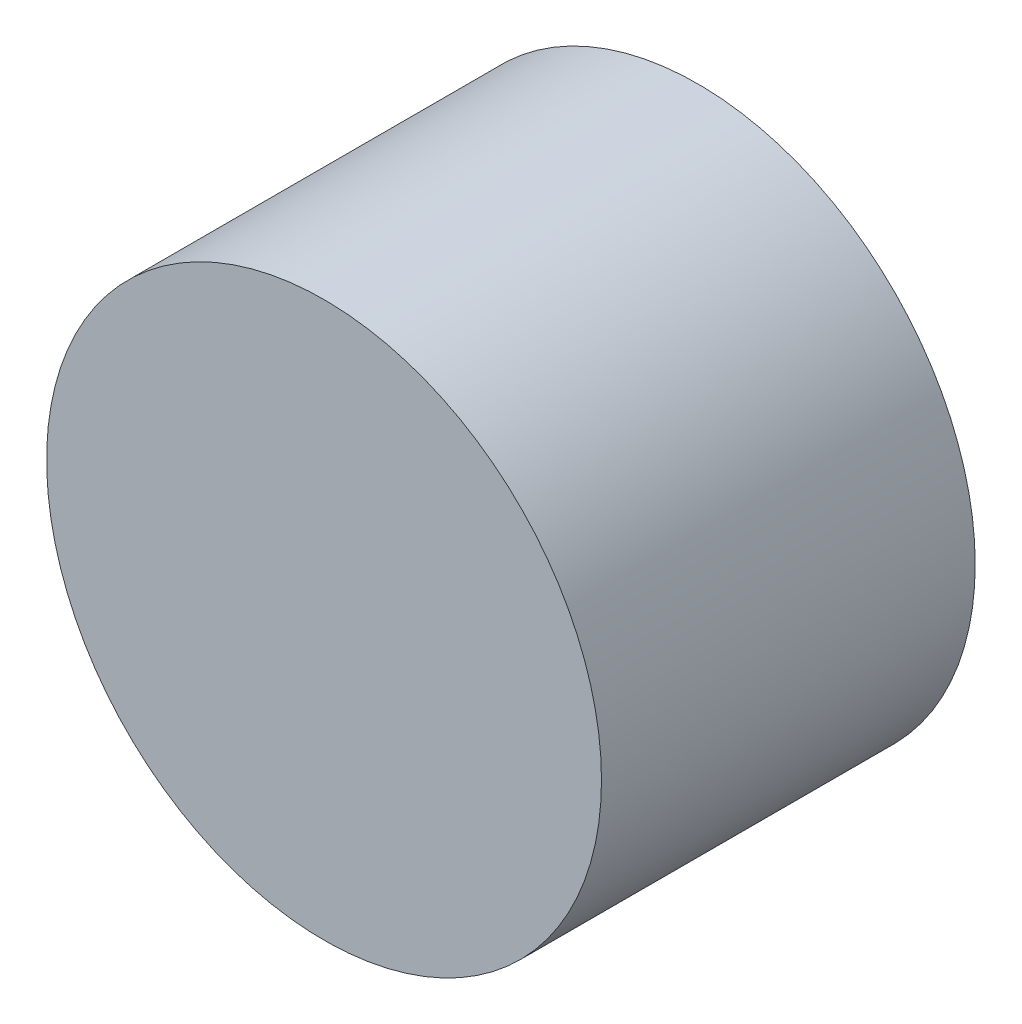
ISO-10303-21;
HEADER;
FILE_DESCRIPTION(('STEP AP214'),'2;1');
FILE_NAME('part.step','',(''),(''),'','','');
FILE_SCHEMA(('AUTOMOTIVE_DESIGN { 1 0 10303 214 1 1 1 1 }'));
ENDSEC;
DATA;
#1=APPLICATION_CONTEXT('core data for automotive mechanical design processes');
#2=APPLICATION_PROTOCOL_DEFINITION('international standard','automotive_design',2000,#1);
#3=PRODUCT_CONTEXT('',#1,'mechanical');
#4=PRODUCT('Part','Part','',(#3));
#5=PRODUCT_RELATED_PRODUCT_CATEGORY('part','',(#4));
#6=PRODUCT_DEFINITION_FORMATION('','',#4);
#7=PRODUCT_DEFINITION_CONTEXT('part definition',#1,'design');
#8=PRODUCT_DEFINITION('design','',#6,#7);
#9=PRODUCT_DEFINITION_SHAPE('','',#8);
#10=(LENGTH_UNIT() NAMED_UNIT(*) SI_UNIT(.MILLI.,.METRE.));
#11=(NAMED_UNIT(*) PLANE_ANGLE_UNIT() SI_UNIT($,.RADIAN.));
#12=(NAMED_UNIT(*) SI_UNIT($,.STERADIAN.) SOLID_ANGLE_UNIT());
#13=UNCERTAINTY_MEASURE_WITH_UNIT(LENGTH_MEASURE(1.E-05),#10,'distance_accuracy_value','');
#14=(GEOMETRIC_REPRESENTATION_CONTEXT(3) GLOBAL_UNCERTAINTY_ASSIGNED_CONTEXT((#13)) GLOBAL_UNIT_ASSIGNED_CONTEXT((#10,
#11,#12)) REPRESENTATION_CONTEXT('',''));
#15=CARTESIAN_POINT('',(0.,0.,0.));
#16=DIRECTION('',(0.,0.,1.));
#17=DIRECTION('',(1.,0.,0.));
#18=AXIS2_PLACEMENT_3D('',#15,#16,#17);
#19=CARTESIAN_POINT('',(0.,0.,-15.));
#20=DIRECTION('',(0.,0.,1.));
#21=DIRECTION('',(1.,0.,0.));
#22=AXIS2_PLACEMENT_3D('',#19,#20,#21);
#23=CYLINDRICAL_SURFACE('',#22,11.1359264223632);
#24=CARTESIAN_POINT('',(0.,0.,-15.));
#25=DIRECTION('',(0.,0.,1.));
#26=DIRECTION('',(1.,0.,0.));
#27=AXIS2_PLACEMENT_3D('',#24,#25,#26);
#28=CIRCLE('',#27,11.1359264223632);
#29=CARTESIAN_POINT('',(11.1359264223632,0.,-15.));
#30=VERTEX_POINT('',#29);
#31=EDGE_CURVE('E10',#30,#30,#28,.T.);
#32=ORIENTED_EDGE('',*,*,#31,.T.);
#33=EDGE_LOOP('',(#32));
#34=FACE_BOUND('',#33,.T.);
#35=CARTESIAN_POINT('',(0.,0.,0.));
#36=DIRECTION('',(0.,0.,1.));
#37=DIRECTION('',(1.,0.,0.));
#38=AXIS2_PLACEMENT_3D('',#35,#36,#37);
#39=CIRCLE('',#38,11.1359264223632);
#40=CARTESIAN_POINT('',(11.1359264223632,0.,0.));
#41=VERTEX_POINT('',#40);
#42=EDGE_CURVE('E36',#41,#41,#39,.T.);
#43=ORIENTED_EDGE('',*,*,#42,.F.);
#44=EDGE_LOOP('',(#43));
#45=FACE_BOUND('',#44,.T.);
#46=ADVANCED_FACE('F33',(#34,#45),#23,.T.);
#47=CARTESIAN_POINT('',(0.,0.,-15.));
#48=DIRECTION('',(0.,0.,1.));
#49=DIRECTION('',(1.,0.,0.));
#50=AXIS2_PLACEMENT_3D('',#47,#48,#49);
#51=PLANE('',#50);
#52=ORIENTED_EDGE('',*,*,#31,.F.);
#53=EDGE_LOOP('',(#52));
#54=FACE_BOUND('',#53,.T.);
#55=ADVANCED_FACE('F48',(#54),#51,.F.);
#56=CARTESIAN_POINT('',(0.,0.,0.));
#57=DIRECTION('',(0.,0.,1.));
#58=DIRECTION('',(1.,0.,0.));
#59=AXIS2_PLACEMENT_3D('',#56,#57,#58);
#60=PLANE('',#59);
#61=ORIENTED_EDGE('',*,*,#42,.T.);
#62=EDGE_LOOP('',(#61));
#63=FACE_BOUND('',#62,.T.);
#64=ADVANCED_FACE('F45',(#63),#60,.T.);
#65=CLOSED_SHELL('',(#46,#55,#64));
#66=MANIFOLD_SOLID_BREP('B2',#65);
#67=ADVANCED_BREP_SHAPE_REPRESENTATION('',(#18,#66),#14);
#68=SHAPE_DEFINITION_REPRESENTATION(#9,#67);
ENDSEC;
END-ISO-10303-21;
